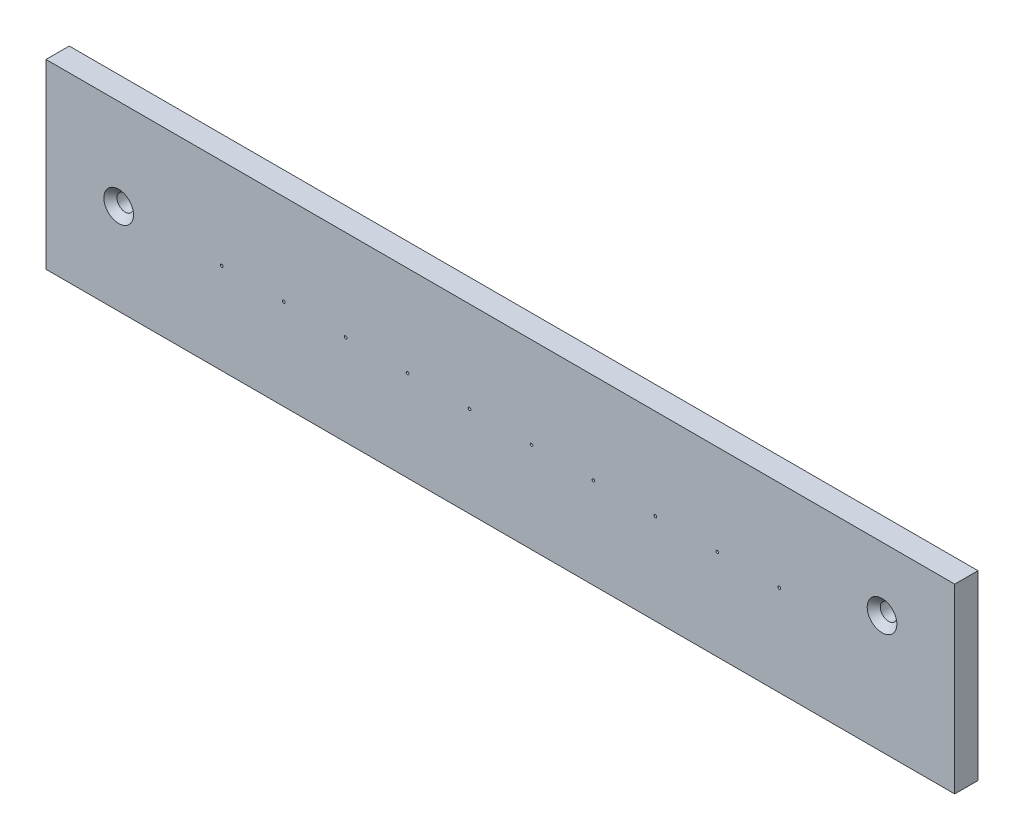
ISO-10303-21;
HEADER;
FILE_DESCRIPTION(('STEP AP214'),'2;1');
FILE_NAME('part.step','',(''),(''),'','','');
FILE_SCHEMA(('AUTOMOTIVE_DESIGN { 1 0 10303 214 1 1 1 1 }'));
ENDSEC;
DATA;
#1=APPLICATION_CONTEXT('core data for automotive mechanical design processes');
#2=APPLICATION_PROTOCOL_DEFINITION('international standard','automotive_design',2000,#1);
#3=PRODUCT_CONTEXT('',#1,'mechanical');
#4=PRODUCT('Part','Part','',(#3));
#5=PRODUCT_RELATED_PRODUCT_CATEGORY('part','',(#4));
#6=PRODUCT_DEFINITION_FORMATION('','',#4);
#7=PRODUCT_DEFINITION_CONTEXT('part definition',#1,'design');
#8=PRODUCT_DEFINITION('design','',#6,#7);
#9=PRODUCT_DEFINITION_SHAPE('','',#8);
#10=(LENGTH_UNIT() NAMED_UNIT(*) SI_UNIT(.MILLI.,.METRE.));
#11=(NAMED_UNIT(*) PLANE_ANGLE_UNIT() SI_UNIT($,.RADIAN.));
#12=(NAMED_UNIT(*) SI_UNIT($,.STERADIAN.) SOLID_ANGLE_UNIT());
#13=UNCERTAINTY_MEASURE_WITH_UNIT(LENGTH_MEASURE(1.E-05),#10,'distance_accuracy_value','');
#14=(GEOMETRIC_REPRESENTATION_CONTEXT(3) GLOBAL_UNCERTAINTY_ASSIGNED_CONTEXT((#13)) GLOBAL_UNIT_ASSIGNED_CONTEXT((#10,
#11,#12)) REPRESENTATION_CONTEXT('',''));
#15=CARTESIAN_POINT('',(0.,0.,0.));
#16=DIRECTION('',(0.,0.,1.));
#17=DIRECTION('',(1.,0.,0.));
#18=AXIS2_PLACEMENT_3D('',#15,#16,#17);
#19=CARTESIAN_POINT('',(96.4446193548387,4.19919354838709,-4.064));
#20=DIRECTION('',(0.,0.,1.));
#21=DIRECTION('',(1.,0.,0.));
#22=AXIS2_PLACEMENT_3D('',#19,#20,#21);
#23=CYLINDRICAL_SURFACE('',#22,0.24003);
#24=CARTESIAN_POINT('',(96.4446193548387,4.19919354838709,-4.064));
#25=DIRECTION('',(0.,0.,1.));
#26=DIRECTION('',(1.,0.,0.));
#27=AXIS2_PLACEMENT_3D('',#24,#25,#26);
#28=CIRCLE('',#27,0.24003);
#29=CARTESIAN_POINT('',(96.6846493548387,4.19919354838709,-4.064));
#30=VERTEX_POINT('',#29);
#31=EDGE_CURVE('E48',#30,#30,#28,.T.);
#32=ORIENTED_EDGE('',*,*,#31,.F.);
#33=EDGE_LOOP('',(#32));
#34=FACE_BOUND('',#33,.T.);
#35=CARTESIAN_POINT('',(96.4446193548387,4.19919354838709,0.));
#36=DIRECTION('',(0.,0.,1.));
#37=DIRECTION('',(1.,0.,0.));
#38=AXIS2_PLACEMENT_3D('',#35,#36,#37);
#39=CIRCLE('',#38,0.24003);
#40=CARTESIAN_POINT('',(96.6846493548387,4.19919354838709,0.));
#41=VERTEX_POINT('',#40);
#42=EDGE_CURVE('E11',#41,#41,#39,.T.);
#43=ORIENTED_EDGE('',*,*,#42,.T.);
#44=EDGE_LOOP('',(#43));
#45=FACE_BOUND('',#44,.T.);
#46=ADVANCED_FACE('F40',(#34,#45),#23,.F.);
#47=CARTESIAN_POINT('',(85.6242193548387,4.19919354838709,-4.064));
#48=DIRECTION('',(0.,0.,1.));
#49=DIRECTION('',(1.,0.,0.));
#50=AXIS2_PLACEMENT_3D('',#47,#48,#49);
#51=CYLINDRICAL_SURFACE('',#50,0.24003);
#52=CARTESIAN_POINT('',(85.6242193548387,4.19919354838709,-4.064));
#53=DIRECTION('',(0.,0.,1.));
#54=DIRECTION('',(1.,0.,0.));
#55=AXIS2_PLACEMENT_3D('',#52,#53,#54);
#56=CIRCLE('',#55,0.24003);
#57=CARTESIAN_POINT('',(85.8642493548387,4.19919354838709,-4.064));
#58=VERTEX_POINT('',#57);
#59=EDGE_CURVE('E169',#58,#58,#56,.T.);
#60=ORIENTED_EDGE('',*,*,#59,.F.);
#61=EDGE_LOOP('',(#60));
#62=FACE_BOUND('',#61,.T.);
#63=CARTESIAN_POINT('',(85.6242193548387,4.19919354838709,0.));
#64=DIRECTION('',(0.,0.,1.));
#65=DIRECTION('',(1.,0.,0.));
#66=AXIS2_PLACEMENT_3D('',#63,#64,#65);
#67=CIRCLE('',#66,0.24003);
#68=CARTESIAN_POINT('',(85.8642493548387,4.19919354838709,0.));
#69=VERTEX_POINT('',#68);
#70=EDGE_CURVE('E172',#69,#69,#67,.T.);
#71=ORIENTED_EDGE('',*,*,#70,.T.);
#72=EDGE_LOOP('',(#71));
#73=FACE_BOUND('',#72,.T.);
#74=ADVANCED_FACE('F180',(#62,#73),#51,.F.);
#75=CARTESIAN_POINT('',(74.8038193548387,4.19919354838709,-4.064));
#76=DIRECTION('',(0.,0.,1.));
#77=DIRECTION('',(1.,0.,0.));
#78=AXIS2_PLACEMENT_3D('',#75,#76,#77);
#79=CYLINDRICAL_SURFACE('',#78,0.24003);
#80=CARTESIAN_POINT('',(74.8038193548387,4.19919354838709,-4.064));
#81=DIRECTION('',(0.,0.,1.));
#82=DIRECTION('',(1.,0.,0.));
#83=AXIS2_PLACEMENT_3D('',#80,#81,#82);
#84=CIRCLE('',#83,0.24003);
#85=CARTESIAN_POINT('',(75.0438493548387,4.19919354838709,-4.064));
#86=VERTEX_POINT('',#85);
#87=EDGE_CURVE('E163',#86,#86,#84,.T.);
#88=ORIENTED_EDGE('',*,*,#87,.F.);
#89=EDGE_LOOP('',(#88));
#90=FACE_BOUND('',#89,.T.);
#91=CARTESIAN_POINT('',(74.8038193548387,4.19919354838709,0.));
#92=DIRECTION('',(0.,0.,1.));
#93=DIRECTION('',(1.,0.,0.));
#94=AXIS2_PLACEMENT_3D('',#91,#92,#93);
#95=CIRCLE('',#94,0.24003);
#96=CARTESIAN_POINT('',(75.0438493548387,4.19919354838709,0.));
#97=VERTEX_POINT('',#96);
#98=EDGE_CURVE('E166',#97,#97,#95,.T.);
#99=ORIENTED_EDGE('',*,*,#98,.T.);
#100=EDGE_LOOP('',(#99));
#101=FACE_BOUND('',#100,.T.);
#102=ADVANCED_FACE('F244',(#90,#101),#79,.F.);
#103=CARTESIAN_POINT('',(63.9834193548387,4.19919354838709,-4.064));
#104=DIRECTION('',(0.,0.,1.));
#105=DIRECTION('',(1.,0.,0.));
#106=AXIS2_PLACEMENT_3D('',#103,#104,#105);
#107=CYLINDRICAL_SURFACE('',#106,0.24003);
#108=CARTESIAN_POINT('',(63.9834193548387,4.19919354838709,-4.064));
#109=DIRECTION('',(0.,0.,1.));
#110=DIRECTION('',(1.,0.,0.));
#111=AXIS2_PLACEMENT_3D('',#108,#109,#110);
#112=CIRCLE('',#111,0.24003);
#113=CARTESIAN_POINT('',(64.2234493548387,4.19919354838709,-4.064));
#114=VERTEX_POINT('',#113);
#115=EDGE_CURVE('E157',#114,#114,#112,.T.);
#116=ORIENTED_EDGE('',*,*,#115,.F.);
#117=EDGE_LOOP('',(#116));
#118=FACE_BOUND('',#117,.T.);
#119=CARTESIAN_POINT('',(63.9834193548387,4.19919354838709,0.));
#120=DIRECTION('',(0.,0.,1.));
#121=DIRECTION('',(1.,0.,0.));
#122=AXIS2_PLACEMENT_3D('',#119,#120,#121);
#123=CIRCLE('',#122,0.24003);
#124=CARTESIAN_POINT('',(64.2234493548387,4.19919354838709,0.));
#125=VERTEX_POINT('',#124);
#126=EDGE_CURVE('E160',#125,#125,#123,.T.);
#127=ORIENTED_EDGE('',*,*,#126,.T.);
#128=EDGE_LOOP('',(#127));
#129=FACE_BOUND('',#128,.T.);
#130=ADVANCED_FACE('F240',(#118,#129),#107,.F.);
#131=CARTESIAN_POINT('',(53.1630193548387,4.19919354838709,-4.064));
#132=DIRECTION('',(0.,0.,1.));
#133=DIRECTION('',(1.,0.,0.));
#134=AXIS2_PLACEMENT_3D('',#131,#132,#133);
#135=CYLINDRICAL_SURFACE('',#134,0.24003);
#136=CARTESIAN_POINT('',(53.1630193548387,4.19919354838709,-4.064));
#137=DIRECTION('',(0.,0.,1.));
#138=DIRECTION('',(1.,0.,0.));
#139=AXIS2_PLACEMENT_3D('',#136,#137,#138);
#140=CIRCLE('',#139,0.24003);
#141=CARTESIAN_POINT('',(53.4030493548387,4.19919354838709,-4.064));
#142=VERTEX_POINT('',#141);
#143=EDGE_CURVE('E151',#142,#142,#140,.T.);
#144=ORIENTED_EDGE('',*,*,#143,.F.);
#145=EDGE_LOOP('',(#144));
#146=FACE_BOUND('',#145,.T.);
#147=CARTESIAN_POINT('',(53.1630193548387,4.19919354838709,0.));
#148=DIRECTION('',(0.,0.,1.));
#149=DIRECTION('',(1.,0.,0.));
#150=AXIS2_PLACEMENT_3D('',#147,#148,#149);
#151=CIRCLE('',#150,0.24003);
#152=CARTESIAN_POINT('',(53.4030493548387,4.19919354838709,0.));
#153=VERTEX_POINT('',#152);
#154=EDGE_CURVE('E154',#153,#153,#151,.T.);
#155=ORIENTED_EDGE('',*,*,#154,.T.);
#156=EDGE_LOOP('',(#155));
#157=FACE_BOUND('',#156,.T.);
#158=ADVANCED_FACE('F236',(#146,#157),#135,.F.);
#159=CARTESIAN_POINT('',(42.3426193548387,4.19919354838709,-4.064));
#160=DIRECTION('',(0.,0.,1.));
#161=DIRECTION('',(1.,0.,0.));
#162=AXIS2_PLACEMENT_3D('',#159,#160,#161);
#163=CYLINDRICAL_SURFACE('',#162,0.24003);
#164=CARTESIAN_POINT('',(42.3426193548387,4.19919354838709,-4.064));
#165=DIRECTION('',(0.,0.,1.));
#166=DIRECTION('',(1.,0.,0.));
#167=AXIS2_PLACEMENT_3D('',#164,#165,#166);
#168=CIRCLE('',#167,0.24003);
#169=CARTESIAN_POINT('',(42.5826493548387,4.19919354838709,-4.064));
#170=VERTEX_POINT('',#169);
#171=EDGE_CURVE('E145',#170,#170,#168,.T.);
#172=ORIENTED_EDGE('',*,*,#171,.F.);
#173=EDGE_LOOP('',(#172));
#174=FACE_BOUND('',#173,.T.);
#175=CARTESIAN_POINT('',(42.3426193548387,4.19919354838709,0.));
#176=DIRECTION('',(0.,0.,1.));
#177=DIRECTION('',(1.,0.,0.));
#178=AXIS2_PLACEMENT_3D('',#175,#176,#177);
#179=CIRCLE('',#178,0.24003);
#180=CARTESIAN_POINT('',(42.5826493548387,4.19919354838709,0.));
#181=VERTEX_POINT('',#180);
#182=EDGE_CURVE('E148',#181,#181,#179,.T.);
#183=ORIENTED_EDGE('',*,*,#182,.T.);
#184=EDGE_LOOP('',(#183));
#185=FACE_BOUND('',#184,.T.);
#186=ADVANCED_FACE('F232',(#174,#185),#163,.F.);
#187=CARTESIAN_POINT('',(31.5222193548387,4.19919354838709,-4.064));
#188=DIRECTION('',(0.,0.,1.));
#189=DIRECTION('',(1.,0.,0.));
#190=AXIS2_PLACEMENT_3D('',#187,#188,#189);
#191=CYLINDRICAL_SURFACE('',#190,0.24003);
#192=CARTESIAN_POINT('',(31.5222193548387,4.19919354838709,-4.064));
#193=DIRECTION('',(0.,0.,1.));
#194=DIRECTION('',(1.,0.,0.));
#195=AXIS2_PLACEMENT_3D('',#192,#193,#194);
#196=CIRCLE('',#195,0.24003);
#197=CARTESIAN_POINT('',(31.7622493548387,4.19919354838709,-4.064));
#198=VERTEX_POINT('',#197);
#199=EDGE_CURVE('E139',#198,#198,#196,.T.);
#200=ORIENTED_EDGE('',*,*,#199,.F.);
#201=EDGE_LOOP('',(#200));
#202=FACE_BOUND('',#201,.T.);
#203=CARTESIAN_POINT('',(31.5222193548387,4.19919354838709,0.));
#204=DIRECTION('',(0.,0.,1.));
#205=DIRECTION('',(1.,0.,0.));
#206=AXIS2_PLACEMENT_3D('',#203,#204,#205);
#207=CIRCLE('',#206,0.24003);
#208=CARTESIAN_POINT('',(31.7622493548387,4.19919354838709,0.));
#209=VERTEX_POINT('',#208);
#210=EDGE_CURVE('E142',#209,#209,#207,.T.);
#211=ORIENTED_EDGE('',*,*,#210,.T.);
#212=EDGE_LOOP('',(#211));
#213=FACE_BOUND('',#212,.T.);
#214=ADVANCED_FACE('F228',(#202,#213),#191,.F.);
#215=CARTESIAN_POINT('',(20.7018193548387,4.19919354838709,-4.064));
#216=DIRECTION('',(0.,0.,1.));
#217=DIRECTION('',(1.,0.,0.));
#218=AXIS2_PLACEMENT_3D('',#215,#216,#217);
#219=CYLINDRICAL_SURFACE('',#218,0.24003);
#220=CARTESIAN_POINT('',(20.7018193548387,4.19919354838709,-4.064));
#221=DIRECTION('',(0.,0.,1.));
#222=DIRECTION('',(1.,0.,0.));
#223=AXIS2_PLACEMENT_3D('',#220,#221,#222);
#224=CIRCLE('',#223,0.24003);
#225=CARTESIAN_POINT('',(20.9418493548387,4.19919354838709,-4.064));
#226=VERTEX_POINT('',#225);
#227=EDGE_CURVE('E133',#226,#226,#224,.T.);
#228=ORIENTED_EDGE('',*,*,#227,.F.);
#229=EDGE_LOOP('',(#228));
#230=FACE_BOUND('',#229,.T.);
#231=CARTESIAN_POINT('',(20.7018193548387,4.19919354838709,0.));
#232=DIRECTION('',(0.,0.,1.));
#233=DIRECTION('',(1.,0.,0.));
#234=AXIS2_PLACEMENT_3D('',#231,#232,#233);
#235=CIRCLE('',#234,0.24003);
#236=CARTESIAN_POINT('',(20.9418493548387,4.19919354838709,0.));
#237=VERTEX_POINT('',#236);
#238=EDGE_CURVE('E136',#237,#237,#235,.T.);
#239=ORIENTED_EDGE('',*,*,#238,.T.);
#240=EDGE_LOOP('',(#239));
#241=FACE_BOUND('',#240,.T.);
#242=ADVANCED_FACE('F210',(#230,#241),#219,.F.);
#243=CARTESIAN_POINT('',(-31.6475806451613,20.0741935483871,-4.064));
#244=DIRECTION('',(-1.,0.,0.));
#245=DIRECTION('',(0.,0.,1.));
#246=AXIS2_PLACEMENT_3D('',#243,#244,#245);
#247=PLANE('',#246);
#248=DIRECTION('',(0.,-1.,0.));
#249=VECTOR('',#248,1.);
#250=CARTESIAN_POINT('',(-31.6475806451613,20.0741935483871,0.));
#251=LINE('',#250,#249);
#252=CARTESIAN_POINT('',(-31.6475806451613,20.0741935483871,0.));
#253=VERTEX_POINT('',#252);
#254=CARTESIAN_POINT('',(-31.6475806451613,-11.6758064516129,0.));
#255=VERTEX_POINT('',#254);
#256=EDGE_CURVE('E109',#253,#255,#251,.T.);
#257=ORIENTED_EDGE('',*,*,#256,.F.);
#258=DIRECTION('',(0.,0.,1.));
#259=VECTOR('',#258,1.);
#260=CARTESIAN_POINT('',(-31.6475806451613,20.0741935483871,-4.064));
#261=LINE('',#260,#259);
#262=CARTESIAN_POINT('',(-31.6475806451613,20.0741935483871,-4.064));
#263=VERTEX_POINT('',#262);
#264=EDGE_CURVE('E56',#263,#253,#261,.T.);
#265=ORIENTED_EDGE('',*,*,#264,.F.);
#266=DIRECTION('',(0.,-1.,0.));
#267=VECTOR('',#266,1.);
#268=CARTESIAN_POINT('',(-31.6475806451613,20.0741935483871,-4.064));
#269=LINE('',#268,#267);
#270=CARTESIAN_POINT('',(-31.6475806451613,-11.6758064516129,-4.064));
#271=VERTEX_POINT('',#270);
#272=EDGE_CURVE('E102',#263,#271,#269,.T.);
#273=ORIENTED_EDGE('',*,*,#272,.T.);
#274=DIRECTION('',(0.,0.,1.));
#275=VECTOR('',#274,1.);
#276=CARTESIAN_POINT('',(-31.6475806451613,-11.6758064516129,-4.064));
#277=LINE('',#276,#275);
#278=EDGE_CURVE('E84',#271,#255,#277,.T.);
#279=ORIENTED_EDGE('',*,*,#278,.T.);
#280=EDGE_LOOP('',(#257,#265,#273,#279));
#281=FACE_BOUND('',#280,.T.);
#282=ADVANCED_FACE('F203',(#281),#247,.T.);
#283=CARTESIAN_POINT('',(-31.6475806451613,20.0741935483871,-4.064));
#284=DIRECTION('',(0.,1.,0.));
#285=DIRECTION('',(0.,0.,1.));
#286=AXIS2_PLACEMENT_3D('',#283,#284,#285);
#287=PLANE('',#286);
#288=DIRECTION('',(-1.,0.,0.));
#289=VECTOR('',#288,1.);
#290=CARTESIAN_POINT('',(-31.6475806451613,20.0741935483871,0.));
#291=LINE('',#290,#289);
#292=CARTESIAN_POINT('',(127.102419354839,20.0741935483871,0.));
#293=VERTEX_POINT('',#292);
#294=EDGE_CURVE('E104',#293,#253,#291,.T.);
#295=ORIENTED_EDGE('',*,*,#294,.F.);
#296=DIRECTION('',(0.,0.,1.));
#297=VECTOR('',#296,1.);
#298=CARTESIAN_POINT('',(127.102419354839,20.0741935483871,-4.064));
#299=LINE('',#298,#297);
#300=CARTESIAN_POINT('',(127.102419354839,20.0741935483871,-4.064));
#301=VERTEX_POINT('',#300);
#302=EDGE_CURVE('E73',#301,#293,#299,.T.);
#303=ORIENTED_EDGE('',*,*,#302,.F.);
#304=DIRECTION('',(-1.,0.,0.));
#305=VECTOR('',#304,1.);
#306=CARTESIAN_POINT('',(-31.6475806451613,20.0741935483871,-4.064));
#307=LINE('',#306,#305);
#308=EDGE_CURVE('E99',#301,#263,#307,.T.);
#309=ORIENTED_EDGE('',*,*,#308,.T.);
#310=ORIENTED_EDGE('',*,*,#264,.T.);
#311=EDGE_LOOP('',(#295,#303,#309,#310));
#312=FACE_BOUND('',#311,.T.);
#313=ADVANCED_FACE('F200',(#312),#287,.T.);
#314=CARTESIAN_POINT('',(127.102419354839,20.0741935483871,-4.064));
#315=DIRECTION('',(1.,0.,0.));
#316=DIRECTION('',(0.,0.,-1.));
#317=AXIS2_PLACEMENT_3D('',#314,#315,#316);
#318=PLANE('',#317);
#319=DIRECTION('',(0.,1.,0.));
#320=VECTOR('',#319,1.);
#321=CARTESIAN_POINT('',(127.102419354839,20.0741935483871,0.));
#322=LINE('',#321,#320);
#323=CARTESIAN_POINT('',(127.102419354839,-11.6758064516129,0.));
#324=VERTEX_POINT('',#323);
#325=EDGE_CURVE('E92',#324,#293,#322,.T.);
#326=ORIENTED_EDGE('',*,*,#325,.F.);
#327=DIRECTION('',(0.,0.,1.));
#328=VECTOR('',#327,1.);
#329=CARTESIAN_POINT('',(127.102419354839,-11.6758064516129,-4.064));
#330=LINE('',#329,#328);
#331=CARTESIAN_POINT('',(127.102419354839,-11.6758064516129,-4.064));
#332=VERTEX_POINT('',#331);
#333=EDGE_CURVE('E87',#332,#324,#330,.T.);
#334=ORIENTED_EDGE('',*,*,#333,.F.);
#335=DIRECTION('',(0.,1.,0.));
#336=VECTOR('',#335,1.);
#337=CARTESIAN_POINT('',(127.102419354839,20.0741935483871,-4.064));
#338=LINE('',#337,#336);
#339=EDGE_CURVE('E90',#332,#301,#338,.T.);
#340=ORIENTED_EDGE('',*,*,#339,.T.);
#341=ORIENTED_EDGE('',*,*,#302,.T.);
#342=EDGE_LOOP('',(#326,#334,#340,#341));
#343=FACE_BOUND('',#342,.T.);
#344=ADVANCED_FACE('F89',(#343),#318,.T.);
#345=CARTESIAN_POINT('',(-31.6475806451613,-11.6758064516129,-4.064));
#346=DIRECTION('',(0.,-1.,0.));
#347=DIRECTION('',(1.,0.,0.));
#348=AXIS2_PLACEMENT_3D('',#345,#346,#347);
#349=PLANE('',#348);
#350=DIRECTION('',(1.,0.,0.));
#351=VECTOR('',#350,1.);
#352=CARTESIAN_POINT('',(-31.6475806451613,-11.6758064516129,0.));
#353=LINE('',#352,#351);
#354=EDGE_CURVE('E112',#255,#324,#353,.T.);
#355=ORIENTED_EDGE('',*,*,#354,.F.);
#356=ORIENTED_EDGE('',*,*,#278,.F.);
#357=DIRECTION('',(1.,0.,0.));
#358=VECTOR('',#357,1.);
#359=CARTESIAN_POINT('',(-31.6475806451613,-11.6758064516129,-4.064));
#360=LINE('',#359,#358);
#361=EDGE_CURVE('E98',#271,#332,#360,.T.);
#362=ORIENTED_EDGE('',*,*,#361,.T.);
#363=ORIENTED_EDGE('',*,*,#333,.T.);
#364=EDGE_LOOP('',(#355,#356,#362,#363));
#365=FACE_BOUND('',#364,.T.);
#366=ADVANCED_FACE('F101',(#365),#349,.T.);
#367=CARTESIAN_POINT('',(0.,0.,-4.064));
#368=DIRECTION('',(0.,0.,1.));
#369=DIRECTION('',(1.,0.,0.));
#370=AXIS2_PLACEMENT_3D('',#367,#368,#369);
#371=PLANE('',#370);
#372=CARTESIAN_POINT('',(9.88141935483869,4.19919354838709,-4.064));
#373=DIRECTION('',(0.,0.,1.));
#374=DIRECTION('',(1.,0.,0.));
#375=AXIS2_PLACEMENT_3D('',#372,#373,#374);
#376=CIRCLE('',#375,0.24003);
#377=CARTESIAN_POINT('',(10.1214493548387,4.19919354838709,-4.064));
#378=VERTEX_POINT('',#377);
#379=EDGE_CURVE('E441',#378,#378,#376,.T.);
#380=ORIENTED_EDGE('',*,*,#379,.T.);
#381=EDGE_LOOP('',(#380));
#382=FACE_BOUND('',#381,.T.);
#383=CARTESIAN_POINT('',(-0.938980645161305,4.19919354838709,-4.064));
#384=DIRECTION('',(0.,0.,1.));
#385=DIRECTION('',(1.,0.,0.));
#386=AXIS2_PLACEMENT_3D('',#383,#384,#385);
#387=CIRCLE('',#386,0.24003);
#388=CARTESIAN_POINT('',(-0.698950645161305,4.19919354838709,-4.064));
#389=VERTEX_POINT('',#388);
#390=EDGE_CURVE('E431',#389,#389,#387,.T.);
#391=ORIENTED_EDGE('',*,*,#390,.T.);
#392=EDGE_LOOP('',(#391));
#393=FACE_BOUND('',#392,.T.);
#394=CARTESIAN_POINT('',(-18.9475806451613,4.19919354838709,-4.064));
#395=DIRECTION('',(0.,0.,1.));
#396=DIRECTION('',(1.,0.,0.));
#397=AXIS2_PLACEMENT_3D('',#394,#395,#396);
#398=CIRCLE('',#397,1.4478);
#399=CARTESIAN_POINT('',(-17.4997806451613,4.19919354838709,-4.064));
#400=VERTEX_POINT('',#399);
#401=EDGE_CURVE('E113',#400,#400,#398,.T.);
#402=ORIENTED_EDGE('',*,*,#401,.T.);
#403=EDGE_LOOP('',(#402));
#404=FACE_BOUND('',#403,.T.);
#405=CARTESIAN_POINT('',(114.402419354839,8.96169354838709,-4.064));
#406=DIRECTION('',(0.,0.,1.));
#407=DIRECTION('',(1.,0.,0.));
#408=AXIS2_PLACEMENT_3D('',#405,#406,#407);
#409=CIRCLE('',#408,1.4478);
#410=CARTESIAN_POINT('',(115.850219354839,8.96169354838709,-4.064));
#411=VERTEX_POINT('',#410);
#412=EDGE_CURVE('E428',#411,#411,#409,.T.);
#413=ORIENTED_EDGE('',*,*,#412,.T.);
#414=EDGE_LOOP('',(#413));
#415=FACE_BOUND('',#414,.T.);
#416=ORIENTED_EDGE('',*,*,#272,.F.);
#417=ORIENTED_EDGE('',*,*,#308,.F.);
#418=ORIENTED_EDGE('',*,*,#339,.F.);
#419=ORIENTED_EDGE('',*,*,#361,.F.);
#420=EDGE_LOOP('',(#416,#417,#418,#419));
#421=FACE_BOUND('',#420,.T.);
#422=ORIENTED_EDGE('',*,*,#227,.T.);
#423=EDGE_LOOP('',(#422));
#424=FACE_BOUND('',#423,.T.);
#425=ORIENTED_EDGE('',*,*,#199,.T.);
#426=EDGE_LOOP('',(#425));
#427=FACE_BOUND('',#426,.T.);
#428=ORIENTED_EDGE('',*,*,#171,.T.);
#429=EDGE_LOOP('',(#428));
#430=FACE_BOUND('',#429,.T.);
#431=ORIENTED_EDGE('',*,*,#143,.T.);
#432=EDGE_LOOP('',(#431));
#433=FACE_BOUND('',#432,.T.);
#434=ORIENTED_EDGE('',*,*,#115,.T.);
#435=EDGE_LOOP('',(#434));
#436=FACE_BOUND('',#435,.T.);
#437=ORIENTED_EDGE('',*,*,#87,.T.);
#438=EDGE_LOOP('',(#437));
#439=FACE_BOUND('',#438,.T.);
#440=ORIENTED_EDGE('',*,*,#59,.T.);
#441=EDGE_LOOP('',(#440));
#442=FACE_BOUND('',#441,.T.);
#443=ORIENTED_EDGE('',*,*,#31,.T.);
#444=EDGE_LOOP('',(#443));
#445=FACE_BOUND('',#444,.T.);
#446=ADVANCED_FACE('F96',(#382,#393,#404,#415,#421,#424,#427,#430,#433,#436,#439,#442,#445),
#371,.F.);
#447=CARTESIAN_POINT('',(0.,0.,0.));
#448=DIRECTION('',(0.,0.,1.));
#449=DIRECTION('',(1.,0.,0.));
#450=AXIS2_PLACEMENT_3D('',#447,#448,#449);
#451=PLANE('',#450);
#452=CARTESIAN_POINT('',(9.88141935483869,4.19919354838709,0.));
#453=DIRECTION('',(0.,0.,1.));
#454=DIRECTION('',(1.,0.,0.));
#455=AXIS2_PLACEMENT_3D('',#452,#453,#454);
#456=CIRCLE('',#455,0.24003);
#457=CARTESIAN_POINT('',(10.1214493548387,4.19919354838709,0.));
#458=VERTEX_POINT('',#457);
#459=EDGE_CURVE('E436',#458,#458,#456,.T.);
#460=ORIENTED_EDGE('',*,*,#459,.F.);
#461=EDGE_LOOP('',(#460));
#462=FACE_BOUND('',#461,.T.);
#463=CARTESIAN_POINT('',(-0.938980645161305,4.19919354838709,0.));
#464=DIRECTION('',(0.,0.,1.));
#465=DIRECTION('',(1.,0.,0.));
#466=AXIS2_PLACEMENT_3D('',#463,#464,#465);
#467=CIRCLE('',#466,0.24003);
#468=CARTESIAN_POINT('',(-0.698950645161305,4.19919354838709,0.));
#469=VERTEX_POINT('',#468);
#470=EDGE_CURVE('E433',#469,#469,#467,.T.);
#471=ORIENTED_EDGE('',*,*,#470,.F.);
#472=EDGE_LOOP('',(#471));
#473=FACE_BOUND('',#472,.T.);
#474=CARTESIAN_POINT('',(114.402419354839,8.96169354838709,0.));
#475=DIRECTION('',(0.,0.,1.));
#476=DIRECTION('',(1.,0.,0.));
#477=AXIS2_PLACEMENT_3D('',#474,#475,#476);
#478=CIRCLE('',#477,2.59080000000002);
#479=CARTESIAN_POINT('',(116.993219354839,8.96169354838709,0.));
#480=VERTEX_POINT('',#479);
#481=EDGE_CURVE('E127',#480,#480,#478,.F.);
#482=ORIENTED_EDGE('',*,*,#481,.T.);
#483=EDGE_LOOP('',(#482));
#484=FACE_BOUND('',#483,.T.);
#485=CARTESIAN_POINT('',(-18.9475806451613,4.19919354838709,0.));
#486=DIRECTION('',(0.,0.,1.));
#487=DIRECTION('',(1.,0.,0.));
#488=AXIS2_PLACEMENT_3D('',#485,#486,#487);
#489=CIRCLE('',#488,2.59080000000002);
#490=CARTESIAN_POINT('',(-16.3567806451613,4.19919354838709,0.));
#491=VERTEX_POINT('',#490);
#492=EDGE_CURVE('E124',#491,#491,#489,.F.);
#493=ORIENTED_EDGE('',*,*,#492,.T.);
#494=EDGE_LOOP('',(#493));
#495=FACE_BOUND('',#494,.T.);
#496=ORIENTED_EDGE('',*,*,#256,.T.);
#497=ORIENTED_EDGE('',*,*,#354,.T.);
#498=ORIENTED_EDGE('',*,*,#325,.T.);
#499=ORIENTED_EDGE('',*,*,#294,.T.);
#500=EDGE_LOOP('',(#496,#497,#498,#499));
#501=FACE_BOUND('',#500,.T.);
#502=ORIENTED_EDGE('',*,*,#238,.F.);
#503=EDGE_LOOP('',(#502));
#504=FACE_BOUND('',#503,.T.);
#505=ORIENTED_EDGE('',*,*,#210,.F.);
#506=EDGE_LOOP('',(#505));
#507=FACE_BOUND('',#506,.T.);
#508=ORIENTED_EDGE('',*,*,#182,.F.);
#509=EDGE_LOOP('',(#508));
#510=FACE_BOUND('',#509,.T.);
#511=ORIENTED_EDGE('',*,*,#154,.F.);
#512=EDGE_LOOP('',(#511));
#513=FACE_BOUND('',#512,.T.);
#514=ORIENTED_EDGE('',*,*,#126,.F.);
#515=EDGE_LOOP('',(#514));
#516=FACE_BOUND('',#515,.T.);
#517=ORIENTED_EDGE('',*,*,#98,.F.);
#518=EDGE_LOOP('',(#517));
#519=FACE_BOUND('',#518,.T.);
#520=ORIENTED_EDGE('',*,*,#70,.F.);
#521=EDGE_LOOP('',(#520));
#522=FACE_BOUND('',#521,.T.);
#523=ORIENTED_EDGE('',*,*,#42,.F.);
#524=EDGE_LOOP('',(#523));
#525=FACE_BOUND('',#524,.T.);
#526=ADVANCED_FACE('F183',(#462,#473,#484,#495,#501,#504,#507,#510,#513,#516,#519,#522,#525),
#451,.T.);
#527=CARTESIAN_POINT('',(114.402419354839,8.96169354838709,-4.064));
#528=DIRECTION('',(0.,0.,1.));
#529=DIRECTION('',(1.,0.,0.));
#530=AXIS2_PLACEMENT_3D('',#527,#528,#529);
#531=CYLINDRICAL_SURFACE('',#530,1.4478);
#532=CARTESIAN_POINT('',(114.402419354839,8.96169354838709,-1.14300000000001));
#533=DIRECTION('',(0.,0.,1.));
#534=DIRECTION('',(1.,0.,0.));
#535=AXIS2_PLACEMENT_3D('',#532,#533,#534);
#536=CIRCLE('',#535,1.4478);
#537=CARTESIAN_POINT('',(115.850219354839,8.96169354838709,-1.14300000000001));
#538=VERTEX_POINT('',#537);
#539=EDGE_CURVE('E119',#538,#538,#536,.T.);
#540=ORIENTED_EDGE('',*,*,#539,.T.);
#541=EDGE_LOOP('',(#540));
#542=FACE_BOUND('',#541,.T.);
#543=ORIENTED_EDGE('',*,*,#412,.F.);
#544=EDGE_LOOP('',(#543));
#545=FACE_BOUND('',#544,.T.);
#546=ADVANCED_FACE('F185',(#542,#545),#531,.F.);
#547=CARTESIAN_POINT('',(-18.9475806451613,4.19919354838709,-4.064));
#548=DIRECTION('',(0.,0.,1.));
#549=DIRECTION('',(1.,0.,0.));
#550=AXIS2_PLACEMENT_3D('',#547,#548,#549);
#551=CYLINDRICAL_SURFACE('',#550,1.4478);
#552=CARTESIAN_POINT('',(-18.9475806451613,4.19919354838709,-1.14300000000001));
#553=DIRECTION('',(0.,0.,1.));
#554=DIRECTION('',(1.,0.,0.));
#555=AXIS2_PLACEMENT_3D('',#552,#553,#554);
#556=CIRCLE('',#555,1.4478);
#557=CARTESIAN_POINT('',(-17.4997806451613,4.19919354838709,-1.14300000000001));
#558=VERTEX_POINT('',#557);
#559=EDGE_CURVE('E130',#558,#558,#556,.T.);
#560=ORIENTED_EDGE('',*,*,#559,.T.);
#561=EDGE_LOOP('',(#560));
#562=FACE_BOUND('',#561,.T.);
#563=ORIENTED_EDGE('',*,*,#401,.F.);
#564=EDGE_LOOP('',(#563));
#565=FACE_BOUND('',#564,.T.);
#566=ADVANCED_FACE('F192',(#562,#565),#551,.F.);
#567=CARTESIAN_POINT('',(114.402419354839,8.96169354838709,-1.14300000000001));
#568=DIRECTION('',(0.,0.,1.));
#569=DIRECTION('',(1.,0.,0.));
#570=AXIS2_PLACEMENT_3D('',#567,#568,#569);
#571=CONICAL_SURFACE('',#570,1.4478,0.785398163397452);
#572=ORIENTED_EDGE('',*,*,#481,.F.);
#573=EDGE_LOOP('',(#572));
#574=FACE_BOUND('',#573,.T.);
#575=ORIENTED_EDGE('',*,*,#539,.F.);
#576=EDGE_LOOP('',(#575));
#577=FACE_BOUND('',#576,.T.);
#578=ADVANCED_FACE('F212',(#574,#577),#571,.F.);
#579=CARTESIAN_POINT('',(-18.9475806451613,4.19919354838709,-1.14300000000001));
#580=DIRECTION('',(0.,0.,1.));
#581=DIRECTION('',(1.,0.,0.));
#582=AXIS2_PLACEMENT_3D('',#579,#580,#581);
#583=CONICAL_SURFACE('',#582,1.4478,0.785398163397452);
#584=ORIENTED_EDGE('',*,*,#492,.F.);
#585=EDGE_LOOP('',(#584));
#586=FACE_BOUND('',#585,.T.);
#587=ORIENTED_EDGE('',*,*,#559,.F.);
#588=EDGE_LOOP('',(#587));
#589=FACE_BOUND('',#588,.T.);
#590=ADVANCED_FACE('F218',(#586,#589),#583,.F.);
#591=CARTESIAN_POINT('',(-0.938980645161305,4.19919354838709,-4.064));
#592=DIRECTION('',(0.,0.,1.));
#593=DIRECTION('',(1.,0.,0.));
#594=AXIS2_PLACEMENT_3D('',#591,#592,#593);
#595=CYLINDRICAL_SURFACE('',#594,0.24003);
#596=ORIENTED_EDGE('',*,*,#390,.F.);
#597=EDGE_LOOP('',(#596));
#598=FACE_BOUND('',#597,.T.);
#599=ORIENTED_EDGE('',*,*,#470,.T.);
#600=EDGE_LOOP('',(#599));
#601=FACE_BOUND('',#600,.T.);
#602=ADVANCED_FACE('F224',(#598,#601),#595,.F.);
#603=CARTESIAN_POINT('',(9.88141935483869,4.19919354838709,-4.064));
#604=DIRECTION('',(0.,0.,1.));
#605=DIRECTION('',(1.,0.,0.));
#606=AXIS2_PLACEMENT_3D('',#603,#604,#605);
#607=CYLINDRICAL_SURFACE('',#606,0.24003);
#608=ORIENTED_EDGE('',*,*,#379,.F.);
#609=EDGE_LOOP('',(#608));
#610=FACE_BOUND('',#609,.T.);
#611=ORIENTED_EDGE('',*,*,#459,.T.);
#612=EDGE_LOOP('',(#611));
#613=FACE_BOUND('',#612,.T.);
#614=ADVANCED_FACE('F316',(#610,#613),#607,.F.);
#615=CLOSED_SHELL('',(#46,#74,#102,#130,#158,#186,#214,#242,#282,#313,#344,#366,#446,#526,#546,
#566,#578,#590,#602,#614));
#616=MANIFOLD_SOLID_BREP('B2',#615);
#617=ADVANCED_BREP_SHAPE_REPRESENTATION('',(#18,#616),#14);
#618=SHAPE_DEFINITION_REPRESENTATION(#9,#617);
ENDSEC;
END-ISO-10303-21;
